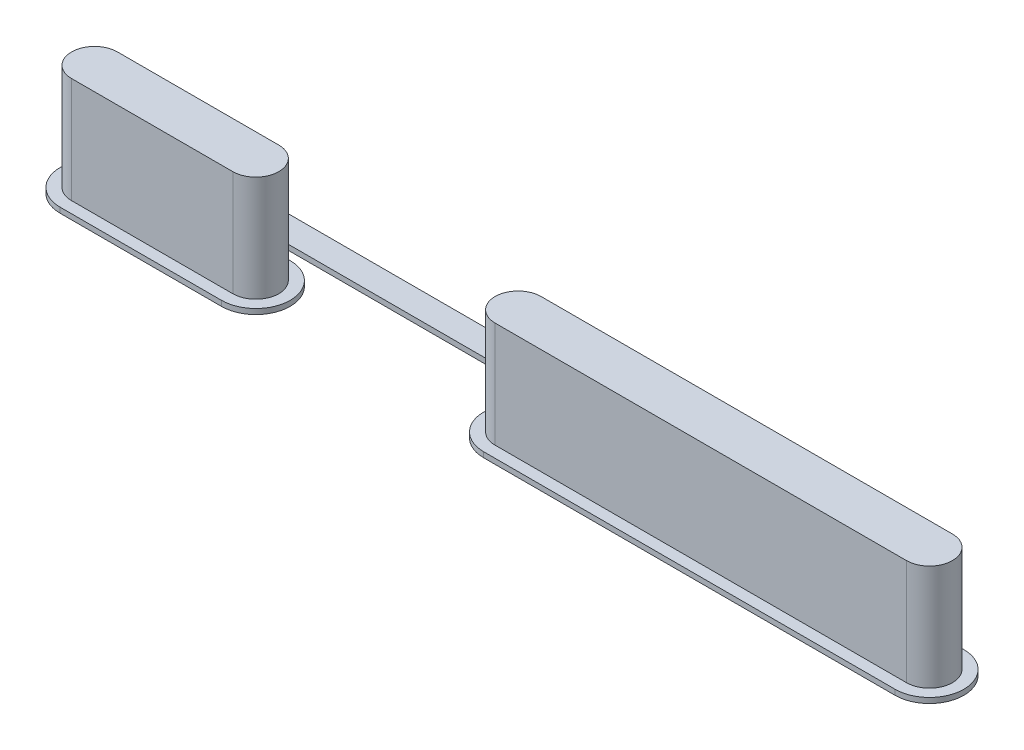
ISO-10303-21;
HEADER;
FILE_DESCRIPTION(('STEP AP214'),'2;1');
FILE_NAME('part.step','',(''),(''),'','','');
FILE_SCHEMA(('AUTOMOTIVE_DESIGN { 1 0 10303 214 1 1 1 1 }'));
ENDSEC;
DATA;
#1=APPLICATION_CONTEXT('core data for automotive mechanical design processes');
#2=APPLICATION_PROTOCOL_DEFINITION('international standard','automotive_design',2000,#1);
#3=PRODUCT_CONTEXT('',#1,'mechanical');
#4=PRODUCT('Part','Part','',(#3));
#5=PRODUCT_RELATED_PRODUCT_CATEGORY('part','',(#4));
#6=PRODUCT_DEFINITION_FORMATION('','',#4);
#7=PRODUCT_DEFINITION_CONTEXT('part definition',#1,'design');
#8=PRODUCT_DEFINITION('design','',#6,#7);
#9=PRODUCT_DEFINITION_SHAPE('','',#8);
#10=(LENGTH_UNIT() NAMED_UNIT(*) SI_UNIT(.MILLI.,.METRE.));
#11=(NAMED_UNIT(*) PLANE_ANGLE_UNIT() SI_UNIT($,.RADIAN.));
#12=(NAMED_UNIT(*) SI_UNIT($,.STERADIAN.) SOLID_ANGLE_UNIT());
#13=UNCERTAINTY_MEASURE_WITH_UNIT(LENGTH_MEASURE(1.E-05),#10,'distance_accuracy_value','');
#14=(GEOMETRIC_REPRESENTATION_CONTEXT(3) GLOBAL_UNCERTAINTY_ASSIGNED_CONTEXT((#13)) GLOBAL_UNIT_ASSIGNED_CONTEXT((#10,
#11,#12)) REPRESENTATION_CONTEXT('',''));
#15=CARTESIAN_POINT('',(0.,0.,0.));
#16=DIRECTION('',(0.,0.,1.));
#17=DIRECTION('',(1.,0.,0.));
#18=AXIS2_PLACEMENT_3D('',#15,#16,#17);
#19=CARTESIAN_POINT('',(16.4719,5.08,0.));
#20=DIRECTION('',(0.,-1.,0.));
#21=DIRECTION('',(0.,0.,-1.));
#22=AXIS2_PLACEMENT_3D('',#19,#20,#21);
#23=CYLINDRICAL_SURFACE('',#22,1.1049);
#24=CARTESIAN_POINT('',(16.4719,0.,0.));
#25=DIRECTION('',(0.,1.,0.));
#26=DIRECTION('',(0.,0.,1.));
#27=AXIS2_PLACEMENT_3D('',#24,#25,#26);
#28=CIRCLE('',#27,1.1049);
#29=CARTESIAN_POINT('',(16.4719,0.,-1.1049));
#30=VERTEX_POINT('',#29);
#31=CARTESIAN_POINT('',(16.4719,0.,1.1049));
#32=VERTEX_POINT('',#31);
#33=EDGE_CURVE('E12',#30,#32,#28,.T.);
#34=ORIENTED_EDGE('',*,*,#33,.T.);
#35=DIRECTION('',(0.,-1.,0.));
#36=VECTOR('',#35,1.);
#37=CARTESIAN_POINT('',(16.4719,5.08,1.1049));
#38=LINE('',#37,#36);
#39=CARTESIAN_POINT('',(16.4719,5.08,1.1049));
#40=VERTEX_POINT('',#39);
#41=EDGE_CURVE('E119',#40,#32,#38,.T.);
#42=ORIENTED_EDGE('',*,*,#41,.F.);
#43=CARTESIAN_POINT('',(16.4719,5.08,0.));
#44=DIRECTION('',(0.,1.,0.));
#45=DIRECTION('',(0.,0.,1.));
#46=AXIS2_PLACEMENT_3D('',#43,#44,#45);
#47=CIRCLE('',#46,1.1049);
#48=CARTESIAN_POINT('',(16.4719,5.08,-1.1049));
#49=VERTEX_POINT('',#48);
#50=EDGE_CURVE('E52',#49,#40,#47,.T.);
#51=ORIENTED_EDGE('',*,*,#50,.F.);
#52=DIRECTION('',(0.,-1.,0.));
#53=VECTOR('',#52,1.);
#54=CARTESIAN_POINT('',(16.4719,5.08,-1.1049));
#55=LINE('',#54,#53);
#56=EDGE_CURVE('E107',#49,#30,#55,.T.);
#57=ORIENTED_EDGE('',*,*,#56,.T.);
#58=EDGE_LOOP('',(#34,#42,#51,#57));
#59=FACE_BOUND('',#58,.T.);
#60=ADVANCED_FACE('F48',(#59),#23,.T.);
#61=CARTESIAN_POINT('',(16.4719,5.08,1.1049));
#62=DIRECTION('',(0.,0.,-1.));
#63=DIRECTION('',(-1.,0.,0.));
#64=AXIS2_PLACEMENT_3D('',#61,#62,#63);
#65=PLANE('',#64);
#66=DIRECTION('',(1.,0.,0.));
#67=VECTOR('',#66,1.);
#68=CARTESIAN_POINT('',(16.4719,0.,1.1049));
#69=LINE('',#68,#67);
#70=CARTESIAN_POINT('',(36.2331,0.,1.1049));
#71=VERTEX_POINT('',#70);
#72=EDGE_CURVE('E58',#32,#71,#69,.T.);
#73=ORIENTED_EDGE('',*,*,#72,.T.);
#74=DIRECTION('',(0.,-1.,0.));
#75=VECTOR('',#74,1.);
#76=CARTESIAN_POINT('',(36.2331,5.08,1.1049));
#77=LINE('',#76,#75);
#78=CARTESIAN_POINT('',(36.2331,5.08,1.1049));
#79=VERTEX_POINT('',#78);
#80=EDGE_CURVE('E103',#79,#71,#77,.T.);
#81=ORIENTED_EDGE('',*,*,#80,.F.);
#82=DIRECTION('',(1.,0.,0.));
#83=VECTOR('',#82,1.);
#84=CARTESIAN_POINT('',(16.4719,5.08,1.1049));
#85=LINE('',#84,#83);
#86=EDGE_CURVE('E82',#40,#79,#85,.T.);
#87=ORIENTED_EDGE('',*,*,#86,.F.);
#88=ORIENTED_EDGE('',*,*,#41,.T.);
#89=EDGE_LOOP('',(#73,#81,#87,#88));
#90=FACE_BOUND('',#89,.T.);
#91=ADVANCED_FACE('F122',(#90),#65,.F.);
#92=CARTESIAN_POINT('',(36.2331,5.08,0.));
#93=DIRECTION('',(0.,-1.,0.));
#94=DIRECTION('',(0.,0.,-1.));
#95=AXIS2_PLACEMENT_3D('',#92,#93,#94);
#96=CYLINDRICAL_SURFACE('',#95,1.1049);
#97=CARTESIAN_POINT('',(36.2331,0.,0.));
#98=DIRECTION('',(0.,1.,0.));
#99=DIRECTION('',(0.,0.,1.));
#100=AXIS2_PLACEMENT_3D('',#97,#98,#99);
#101=CIRCLE('',#100,1.1049);
#102=CARTESIAN_POINT('',(36.2331,0.,-1.1049));
#103=VERTEX_POINT('',#102);
#104=EDGE_CURVE('E98',#71,#103,#101,.T.);
#105=ORIENTED_EDGE('',*,*,#104,.T.);
#106=DIRECTION('',(0.,-1.,0.));
#107=VECTOR('',#106,1.);
#108=CARTESIAN_POINT('',(36.2331,5.08,-1.1049));
#109=LINE('',#108,#107);
#110=CARTESIAN_POINT('',(36.2331,5.08,-1.1049));
#111=VERTEX_POINT('',#110);
#112=EDGE_CURVE('E101',#111,#103,#109,.T.);
#113=ORIENTED_EDGE('',*,*,#112,.F.);
#114=CARTESIAN_POINT('',(36.2331,5.08,0.));
#115=DIRECTION('',(0.,1.,0.));
#116=DIRECTION('',(0.,0.,1.));
#117=AXIS2_PLACEMENT_3D('',#114,#115,#116);
#118=CIRCLE('',#117,1.1049);
#119=EDGE_CURVE('E115',#79,#111,#118,.T.);
#120=ORIENTED_EDGE('',*,*,#119,.F.);
#121=ORIENTED_EDGE('',*,*,#80,.T.);
#122=EDGE_LOOP('',(#105,#113,#120,#121));
#123=FACE_BOUND('',#122,.T.);
#124=ADVANCED_FACE('F99',(#123),#96,.T.);
#125=CARTESIAN_POINT('',(16.4719,5.08,-1.1049));
#126=DIRECTION('',(0.,0.,1.));
#127=DIRECTION('',(1.,0.,0.));
#128=AXIS2_PLACEMENT_3D('',#125,#126,#127);
#129=PLANE('',#128);
#130=DIRECTION('',(-1.,0.,0.));
#131=VECTOR('',#130,1.);
#132=CARTESIAN_POINT('',(16.4719,0.,-1.1049));
#133=LINE('',#132,#131);
#134=EDGE_CURVE('E92',#103,#30,#133,.T.);
#135=ORIENTED_EDGE('',*,*,#134,.T.);
#136=ORIENTED_EDGE('',*,*,#56,.F.);
#137=DIRECTION('',(-1.,0.,0.));
#138=VECTOR('',#137,1.);
#139=CARTESIAN_POINT('',(16.4719,5.08,-1.1049));
#140=LINE('',#139,#138);
#141=EDGE_CURVE('E106',#111,#49,#140,.T.);
#142=ORIENTED_EDGE('',*,*,#141,.F.);
#143=ORIENTED_EDGE('',*,*,#112,.T.);
#144=EDGE_LOOP('',(#135,#136,#142,#143));
#145=FACE_BOUND('',#144,.T.);
#146=ADVANCED_FACE('F105',(#145),#129,.F.);
#147=CARTESIAN_POINT('',(16.4719,5.08,0.));
#148=DIRECTION('',(0.,1.,0.));
#149=DIRECTION('',(0.,0.,1.));
#150=AXIS2_PLACEMENT_3D('',#147,#148,#149);
#151=PLANE('',#150);
#152=ORIENTED_EDGE('',*,*,#50,.T.);
#153=ORIENTED_EDGE('',*,*,#86,.T.);
#154=ORIENTED_EDGE('',*,*,#119,.T.);
#155=ORIENTED_EDGE('',*,*,#141,.T.);
#156=EDGE_LOOP('',(#152,#153,#154,#155));
#157=FACE_BOUND('',#156,.T.);
#158=ADVANCED_FACE('F50',(#157),#151,.T.);
#159=CARTESIAN_POINT('',(16.4719,0.,0.));
#160=DIRECTION('',(0.,1.,0.));
#161=DIRECTION('',(0.,0.,1.));
#162=AXIS2_PLACEMENT_3D('',#159,#160,#161);
#163=PLANE('',#162);
#164=ORIENTED_EDGE('',*,*,#33,.F.);
#165=ORIENTED_EDGE('',*,*,#134,.F.);
#166=ORIENTED_EDGE('',*,*,#104,.F.);
#167=ORIENTED_EDGE('',*,*,#72,.F.);
#168=EDGE_LOOP('',(#164,#165,#166,#167));
#169=FACE_BOUND('',#168,.T.);
#170=ADVANCED_FACE('F109',(#169),#163,.F.);
#171=CLOSED_SHELL('',(#60,#91,#124,#146,#158,#170));
#172=MANIFOLD_SOLID_BREP('B2',#171);
#173=CARTESIAN_POINT('',(-3.8735,-0.254,-1.651));
#174=DIRECTION('',(0.,0.,-1.));
#175=DIRECTION('',(-1.,0.,0.));
#176=AXIS2_PLACEMENT_3D('',#173,#174,#175);
#177=PLANE('',#176);
#178=DIRECTION('',(-1.,0.,0.));
#179=VECTOR('',#178,1.);
#180=CARTESIAN_POINT('',(-3.8735,0.,-1.651));
#181=LINE('',#180,#179);
#182=CARTESIAN_POINT('',(-0.889000000000001,0.,-1.651));
#183=VERTEX_POINT('',#182);
#184=CARTESIAN_POINT('',(-3.8735,0.,-1.651));
#185=VERTEX_POINT('',#184);
#186=EDGE_CURVE('E491',#183,#185,#181,.T.);
#187=ORIENTED_EDGE('',*,*,#186,.F.);
#188=DIRECTION('',(0.,1.,0.));
#189=VECTOR('',#188,1.);
#190=CARTESIAN_POINT('',(-0.889,-0.254,-1.651));
#191=LINE('',#190,#189);
#192=CARTESIAN_POINT('',(-0.889000000000001,-0.254,-1.651));
#193=VERTEX_POINT('',#192);
#194=EDGE_CURVE('E537',#183,#193,#191,.F.);
#195=ORIENTED_EDGE('',*,*,#194,.T.);
#196=DIRECTION('',(-1.,0.,0.));
#197=VECTOR('',#196,1.);
#198=CARTESIAN_POINT('',(-3.8735,-0.254,-1.651));
#199=LINE('',#198,#197);
#200=CARTESIAN_POINT('',(-3.8735,-0.254,-1.651));
#201=VERTEX_POINT('',#200);
#202=EDGE_CURVE('E479',#193,#201,#199,.T.);
#203=ORIENTED_EDGE('',*,*,#202,.T.);
#204=DIRECTION('',(0.,1.,0.));
#205=VECTOR('',#204,1.);
#206=CARTESIAN_POINT('',(-3.8735,-0.254,-1.651));
#207=LINE('',#206,#205);
#208=EDGE_CURVE('E493',#201,#185,#207,.T.);
#209=ORIENTED_EDGE('',*,*,#208,.T.);
#210=EDGE_LOOP('',(#187,#195,#203,#209));
#211=FACE_BOUND('',#210,.T.);
#212=ADVANCED_FACE('F172',(#211),#177,.T.);
#213=CARTESIAN_POINT('',(-3.8735,5.08,0.));
#214=DIRECTION('',(0.,-1.,0.));
#215=DIRECTION('',(0.,0.,-1.));
#216=AXIS2_PLACEMENT_3D('',#213,#214,#215);
#217=CYLINDRICAL_SURFACE('',#216,1.1049);
#218=CARTESIAN_POINT('',(-3.8735,0.,0.));
#219=DIRECTION('',(0.,1.,0.));
#220=DIRECTION('',(0.,0.,1.));
#221=AXIS2_PLACEMENT_3D('',#218,#219,#220);
#222=CIRCLE('',#221,1.1049);
#223=CARTESIAN_POINT('',(-3.8735,0.,-1.1049));
#224=VERTEX_POINT('',#223);
#225=CARTESIAN_POINT('',(-3.8735,0.,1.1049));
#226=VERTEX_POINT('',#225);
#227=EDGE_CURVE('E496',#224,#226,#222,.T.);
#228=ORIENTED_EDGE('',*,*,#227,.T.);
#229=DIRECTION('',(0.,-1.,0.));
#230=VECTOR('',#229,1.);
#231=CARTESIAN_POINT('',(-3.8735,5.08,1.1049));
#232=LINE('',#231,#230);
#233=CARTESIAN_POINT('',(-3.8735,5.08,1.1049));
#234=VERTEX_POINT('',#233);
#235=EDGE_CURVE('E531',#234,#226,#232,.T.);
#236=ORIENTED_EDGE('',*,*,#235,.F.);
#237=CARTESIAN_POINT('',(-3.8735,5.08,0.));
#238=DIRECTION('',(0.,1.,0.));
#239=DIRECTION('',(0.,0.,1.));
#240=AXIS2_PLACEMENT_3D('',#237,#238,#239);
#241=CIRCLE('',#240,1.1049);
#242=CARTESIAN_POINT('',(-3.8735,5.08,-1.1049));
#243=VERTEX_POINT('',#242);
#244=EDGE_CURVE('E502',#243,#234,#241,.T.);
#245=ORIENTED_EDGE('',*,*,#244,.F.);
#246=DIRECTION('',(0.,-1.,0.));
#247=VECTOR('',#246,1.);
#248=CARTESIAN_POINT('',(-3.8735,5.08,-1.1049));
#249=LINE('',#248,#247);
#250=EDGE_CURVE('E512',#243,#224,#249,.T.);
#251=ORIENTED_EDGE('',*,*,#250,.T.);
#252=EDGE_LOOP('',(#228,#236,#245,#251));
#253=FACE_BOUND('',#252,.T.);
#254=ADVANCED_FACE('F587',(#253),#217,.T.);
#255=CARTESIAN_POINT('',(-3.8735,5.08,1.1049));
#256=DIRECTION('',(0.,0.,-1.));
#257=DIRECTION('',(-1.,0.,0.));
#258=AXIS2_PLACEMENT_3D('',#255,#256,#257);
#259=PLANE('',#258);
#260=DIRECTION('',(1.,0.,0.));
#261=VECTOR('',#260,1.);
#262=CARTESIAN_POINT('',(-3.8735,0.,1.1049));
#263=LINE('',#262,#261);
#264=CARTESIAN_POINT('',(3.8735,0.,1.1049));
#265=VERTEX_POINT('',#264);
#266=EDGE_CURVE('E515',#226,#265,#263,.T.);
#267=ORIENTED_EDGE('',*,*,#266,.T.);
#268=DIRECTION('',(0.,-1.,0.));
#269=VECTOR('',#268,1.);
#270=CARTESIAN_POINT('',(3.8735,5.08,1.1049));
#271=LINE('',#270,#269);
#272=CARTESIAN_POINT('',(3.8735,5.08,1.1049));
#273=VERTEX_POINT('',#272);
#274=EDGE_CURVE('E528',#273,#265,#271,.T.);
#275=ORIENTED_EDGE('',*,*,#274,.F.);
#276=DIRECTION('',(1.,0.,0.));
#277=VECTOR('',#276,1.);
#278=CARTESIAN_POINT('',(-3.8735,5.08,1.1049));
#279=LINE('',#278,#277);
#280=EDGE_CURVE('E505',#234,#273,#279,.T.);
#281=ORIENTED_EDGE('',*,*,#280,.F.);
#282=ORIENTED_EDGE('',*,*,#235,.T.);
#283=EDGE_LOOP('',(#267,#275,#281,#282));
#284=FACE_BOUND('',#283,.T.);
#285=ADVANCED_FACE('F596',(#284),#259,.F.);
#286=CARTESIAN_POINT('',(3.8735,5.08,0.));
#287=DIRECTION('',(0.,-1.,0.));
#288=DIRECTION('',(0.,0.,-1.));
#289=AXIS2_PLACEMENT_3D('',#286,#287,#288);
#290=CYLINDRICAL_SURFACE('',#289,1.1049);
#291=CARTESIAN_POINT('',(3.8735,0.,0.));
#292=DIRECTION('',(0.,1.,0.));
#293=DIRECTION('',(0.,0.,1.));
#294=AXIS2_PLACEMENT_3D('',#291,#292,#293);
#295=CIRCLE('',#294,1.1049);
#296=CARTESIAN_POINT('',(3.8735,0.,-1.1049));
#297=VERTEX_POINT('',#296);
#298=EDGE_CURVE('E518',#265,#297,#295,.T.);
#299=ORIENTED_EDGE('',*,*,#298,.T.);
#300=DIRECTION('',(0.,-1.,0.));
#301=VECTOR('',#300,1.);
#302=CARTESIAN_POINT('',(3.8735,5.08,-1.1049));
#303=LINE('',#302,#301);
#304=CARTESIAN_POINT('',(3.8735,5.08,-1.1049));
#305=VERTEX_POINT('',#304);
#306=EDGE_CURVE('E525',#305,#297,#303,.T.);
#307=ORIENTED_EDGE('',*,*,#306,.F.);
#308=CARTESIAN_POINT('',(3.8735,5.08,0.));
#309=DIRECTION('',(0.,1.,0.));
#310=DIRECTION('',(0.,0.,1.));
#311=AXIS2_PLACEMENT_3D('',#308,#309,#310);
#312=CIRCLE('',#311,1.1049);
#313=EDGE_CURVE('E508',#273,#305,#312,.T.);
#314=ORIENTED_EDGE('',*,*,#313,.F.);
#315=ORIENTED_EDGE('',*,*,#274,.T.);
#316=EDGE_LOOP('',(#299,#307,#314,#315));
#317=FACE_BOUND('',#316,.T.);
#318=ADVANCED_FACE('F680',(#317),#290,.T.);
#319=CARTESIAN_POINT('',(-3.8735,5.08,-1.1049));
#320=DIRECTION('',(0.,0.,1.));
#321=DIRECTION('',(1.,0.,0.));
#322=AXIS2_PLACEMENT_3D('',#319,#320,#321);
#323=PLANE('',#322);
#324=DIRECTION('',(-1.,0.,0.));
#325=VECTOR('',#324,1.);
#326=CARTESIAN_POINT('',(-3.8735,0.,-1.1049));
#327=LINE('',#326,#325);
#328=EDGE_CURVE('E506',#297,#224,#327,.T.);
#329=ORIENTED_EDGE('',*,*,#328,.T.);
#330=ORIENTED_EDGE('',*,*,#250,.F.);
#331=DIRECTION('',(-1.,0.,0.));
#332=VECTOR('',#331,1.);
#333=CARTESIAN_POINT('',(-3.8735,5.08,-1.1049));
#334=LINE('',#333,#332);
#335=EDGE_CURVE('E510',#305,#243,#334,.T.);
#336=ORIENTED_EDGE('',*,*,#335,.F.);
#337=ORIENTED_EDGE('',*,*,#306,.T.);
#338=EDGE_LOOP('',(#329,#330,#336,#337));
#339=FACE_BOUND('',#338,.T.);
#340=ADVANCED_FACE('F674',(#339),#323,.F.);
#341=CARTESIAN_POINT('',(-3.8735,5.08,0.));
#342=DIRECTION('',(0.,1.,0.));
#343=DIRECTION('',(0.,0.,1.));
#344=AXIS2_PLACEMENT_3D('',#341,#342,#343);
#345=PLANE('',#344);
#346=ORIENTED_EDGE('',*,*,#244,.T.);
#347=ORIENTED_EDGE('',*,*,#280,.T.);
#348=ORIENTED_EDGE('',*,*,#313,.T.);
#349=ORIENTED_EDGE('',*,*,#335,.T.);
#350=EDGE_LOOP('',(#346,#347,#348,#349));
#351=FACE_BOUND('',#350,.T.);
#352=ADVANCED_FACE('F670',(#351),#345,.T.);
#353=CARTESIAN_POINT('',(-3.8735,0.,0.));
#354=DIRECTION('',(0.,1.,0.));
#355=DIRECTION('',(0.,0.,1.));
#356=AXIS2_PLACEMENT_3D('',#353,#354,#355);
#357=PLANE('',#356);
#358=CARTESIAN_POINT('',(-3.8735,0.,0.));
#359=DIRECTION('',(0.,1.,0.));
#360=DIRECTION('',(0.,0.,1.));
#361=AXIS2_PLACEMENT_3D('',#358,#359,#360);
#362=CIRCLE('',#361,1.651);
#363=CARTESIAN_POINT('',(-3.8735,0.,1.651));
#364=VERTEX_POINT('',#363);
#365=EDGE_CURVE('E426',#185,#364,#362,.T.);
#366=ORIENTED_EDGE('',*,*,#365,.T.);
#367=DIRECTION('',(1.,0.,0.));
#368=VECTOR('',#367,1.);
#369=CARTESIAN_POINT('',(-3.8735,0.,1.651));
#370=LINE('',#369,#368);
#371=CARTESIAN_POINT('',(3.8735,0.,1.651));
#372=VERTEX_POINT('',#371);
#373=EDGE_CURVE('E485',#364,#372,#370,.T.);
#374=ORIENTED_EDGE('',*,*,#373,.T.);
#375=CARTESIAN_POINT('',(3.8735,0.,0.));
#376=DIRECTION('',(0.,1.,0.));
#377=DIRECTION('',(0.,0.,1.));
#378=AXIS2_PLACEMENT_3D('',#375,#376,#377);
#379=CIRCLE('',#378,1.651);
#380=CARTESIAN_POINT('',(3.8735,0.,-1.651));
#381=VERTEX_POINT('',#380);
#382=EDGE_CURVE('E488',#372,#381,#379,.T.);
#383=ORIENTED_EDGE('',*,*,#382,.T.);
#384=CARTESIAN_POINT('',(0.888999999999999,0.,-1.651));
#385=VERTEX_POINT('',#384);
#386=EDGE_CURVE('E473',#381,#385,#181,.T.);
#387=ORIENTED_EDGE('',*,*,#386,.T.);
#388=CARTESIAN_POINT('',(0.889,0.,-1.905));
#389=DIRECTION('',(0.,1.,0.));
#390=DIRECTION('',(0.,0.,1.));
#391=AXIS2_PLACEMENT_3D('',#388,#389,#390);
#392=CIRCLE('',#391,0.254);
#393=CARTESIAN_POINT('',(0.635,0.,-1.905));
#394=VERTEX_POINT('',#393);
#395=EDGE_CURVE('E180',#385,#394,#392,.F.);
#396=ORIENTED_EDGE('',*,*,#395,.T.);
#397=DIRECTION('',(0.,0.,-1.));
#398=VECTOR('',#397,1.);
#399=CARTESIAN_POINT('',(0.635,0.,-1.651));
#400=LINE('',#399,#398);
#401=CARTESIAN_POINT('',(0.635,0.,-2.032));
#402=VERTEX_POINT('',#401);
#403=EDGE_CURVE('E441',#394,#402,#400,.T.);
#404=ORIENTED_EDGE('',*,*,#403,.T.);
#405=CARTESIAN_POINT('',(0.889,0.,-2.032));
#406=DIRECTION('',(0.,1.,0.));
#407=DIRECTION('',(1.,0.,0.));
#408=AXIS2_PLACEMENT_3D('',#405,#406,#407);
#409=CIRCLE('',#408,0.254);
#410=CARTESIAN_POINT('',(0.889,0.,-2.286));
#411=VERTEX_POINT('',#410);
#412=EDGE_CURVE('E443',#402,#411,#409,.F.);
#413=ORIENTED_EDGE('',*,*,#412,.T.);
#414=DIRECTION('',(1.,0.,0.));
#415=VECTOR('',#414,1.);
#416=CARTESIAN_POINT('',(0.889,0.,-2.286));
#417=LINE('',#416,#415);
#418=CARTESIAN_POINT('',(25.4635,0.,-2.286));
#419=VERTEX_POINT('',#418);
#420=EDGE_CURVE('E446',#411,#419,#417,.T.);
#421=ORIENTED_EDGE('',*,*,#420,.T.);
#422=CARTESIAN_POINT('',(25.4635,0.,-2.032));
#423=DIRECTION('',(0.,1.,0.));
#424=DIRECTION('',(1.,0.,0.));
#425=AXIS2_PLACEMENT_3D('',#422,#423,#424);
#426=CIRCLE('',#425,0.254);
#427=CARTESIAN_POINT('',(25.7175,0.,-2.032));
#428=VERTEX_POINT('',#427);
#429=EDGE_CURVE('E449',#419,#428,#426,.F.);
#430=ORIENTED_EDGE('',*,*,#429,.T.);
#431=DIRECTION('',(0.,0.,-1.));
#432=VECTOR('',#431,1.);
#433=CARTESIAN_POINT('',(25.7175,0.,-2.032));
#434=LINE('',#433,#432);
#435=CARTESIAN_POINT('',(25.7175,0.,-1.905));
#436=VERTEX_POINT('',#435);
#437=EDGE_CURVE('E383',#428,#436,#434,.F.);
#438=ORIENTED_EDGE('',*,*,#437,.T.);
#439=CARTESIAN_POINT('',(25.4635,0.,-1.905));
#440=DIRECTION('',(0.,1.,0.));
#441=DIRECTION('',(0.,0.,1.));
#442=AXIS2_PLACEMENT_3D('',#439,#440,#441);
#443=CIRCLE('',#442,0.254);
#444=CARTESIAN_POINT('',(25.4635,0.,-1.651));
#445=VERTEX_POINT('',#444);
#446=EDGE_CURVE('E364',#436,#445,#443,.F.);
#447=ORIENTED_EDGE('',*,*,#446,.T.);
#448=DIRECTION('',(-1.,0.,0.));
#449=VECTOR('',#448,1.);
#450=CARTESIAN_POINT('',(16.4719,0.,-1.651));
#451=LINE('',#450,#449);
#452=CARTESIAN_POINT('',(16.4719,0.,-1.651));
#453=VERTEX_POINT('',#452);
#454=EDGE_CURVE('E355',#445,#453,#451,.T.);
#455=ORIENTED_EDGE('',*,*,#454,.T.);
#456=CARTESIAN_POINT('',(16.4719,0.,0.));
#457=DIRECTION('',(0.,1.,0.));
#458=DIRECTION('',(0.,0.,1.));
#459=AXIS2_PLACEMENT_3D('',#456,#457,#458);
#460=CIRCLE('',#459,1.651);
#461=CARTESIAN_POINT('',(16.4719,0.,1.651));
#462=VERTEX_POINT('',#461);
#463=EDGE_CURVE('E362',#453,#462,#460,.T.);
#464=ORIENTED_EDGE('',*,*,#463,.T.);
#465=DIRECTION('',(1.,0.,0.));
#466=VECTOR('',#465,1.);
#467=CARTESIAN_POINT('',(16.4719,0.,1.651));
#468=LINE('',#467,#466);
#469=CARTESIAN_POINT('',(36.2331,0.,1.651));
#470=VERTEX_POINT('',#469);
#471=EDGE_CURVE('E384',#462,#470,#468,.T.);
#472=ORIENTED_EDGE('',*,*,#471,.T.);
#473=CARTESIAN_POINT('',(36.2331,0.,0.));
#474=DIRECTION('',(0.,1.,0.));
#475=DIRECTION('',(0.,0.,1.));
#476=AXIS2_PLACEMENT_3D('',#473,#474,#475);
#477=CIRCLE('',#476,1.651);
#478=CARTESIAN_POINT('',(36.2331,0.,-1.651));
#479=VERTEX_POINT('',#478);
#480=EDGE_CURVE('E388',#470,#479,#477,.T.);
#481=ORIENTED_EDGE('',*,*,#480,.T.);
#482=CARTESIAN_POINT('',(27.2415,0.,-1.651));
#483=VERTEX_POINT('',#482);
#484=EDGE_CURVE('E367',#479,#483,#451,.T.);
#485=ORIENTED_EDGE('',*,*,#484,.T.);
#486=CARTESIAN_POINT('',(27.2415,0.,-1.905));
#487=DIRECTION('',(0.,1.,0.));
#488=DIRECTION('',(0.,0.,1.));
#489=AXIS2_PLACEMENT_3D('',#486,#487,#488);
#490=CIRCLE('',#489,0.254);
#491=CARTESIAN_POINT('',(26.9875,0.,-1.905));
#492=VERTEX_POINT('',#491);
#493=EDGE_CURVE('E557',#483,#492,#490,.F.);
#494=ORIENTED_EDGE('',*,*,#493,.T.);
#495=DIRECTION('',(0.,0.,-1.));
#496=VECTOR('',#495,1.);
#497=CARTESIAN_POINT('',(26.9875,0.,-2.032));
#498=LINE('',#497,#496);
#499=CARTESIAN_POINT('',(26.9875,0.,-2.032));
#500=VERTEX_POINT('',#499);
#501=EDGE_CURVE('E386',#500,#492,#498,.F.);
#502=ORIENTED_EDGE('',*,*,#501,.F.);
#503=CARTESIAN_POINT('',(25.4635,0.,-2.032));
#504=DIRECTION('',(0.,1.,0.));
#505=DIRECTION('',(1.,0.,0.));
#506=AXIS2_PLACEMENT_3D('',#503,#504,#505);
#507=CIRCLE('',#506,1.524);
#508=CARTESIAN_POINT('',(25.4635,0.,-3.556));
#509=VERTEX_POINT('',#508);
#510=EDGE_CURVE('E430',#509,#500,#507,.F.);
#511=ORIENTED_EDGE('',*,*,#510,.F.);
#512=DIRECTION('',(1.,0.,0.));
#513=VECTOR('',#512,1.);
#514=CARTESIAN_POINT('',(0.889,0.,-3.556));
#515=LINE('',#514,#513);
#516=CARTESIAN_POINT('',(0.889,0.,-3.556));
#517=VERTEX_POINT('',#516);
#518=EDGE_CURVE('E433',#517,#509,#515,.T.);
#519=ORIENTED_EDGE('',*,*,#518,.F.);
#520=CARTESIAN_POINT('',(0.889,0.,-2.032));
#521=DIRECTION('',(0.,1.,0.));
#522=DIRECTION('',(1.,0.,0.));
#523=AXIS2_PLACEMENT_3D('',#520,#521,#522);
#524=CIRCLE('',#523,1.524);
#525=CARTESIAN_POINT('',(-0.635,0.,-2.032));
#526=VERTEX_POINT('',#525);
#527=EDGE_CURVE('E436',#526,#517,#524,.F.);
#528=ORIENTED_EDGE('',*,*,#527,.F.);
#529=DIRECTION('',(0.,0.,-1.));
#530=VECTOR('',#529,1.);
#531=CARTESIAN_POINT('',(-0.635,0.,-1.651));
#532=LINE('',#531,#530);
#533=CARTESIAN_POINT('',(-0.635,0.,-1.905));
#534=VERTEX_POINT('',#533);
#535=EDGE_CURVE('E439',#534,#526,#532,.T.);
#536=ORIENTED_EDGE('',*,*,#535,.F.);
#537=CARTESIAN_POINT('',(-0.889,0.,-1.905));
#538=DIRECTION('',(0.,1.,0.));
#539=DIRECTION('',(0.,0.,1.));
#540=AXIS2_PLACEMENT_3D('',#537,#538,#539);
#541=CIRCLE('',#540,0.254);
#542=EDGE_CURVE('E553',#534,#183,#541,.F.);
#543=ORIENTED_EDGE('',*,*,#542,.T.);
#544=ORIENTED_EDGE('',*,*,#186,.T.);
#545=EDGE_LOOP('',(#366,#374,#383,#387,#396,#404,#413,#421,#430,#438,#447,#455,#464,#472,#481,
#485,#494,#502,#511,#519,#528,#536,#543,#544));
#546=FACE_BOUND('',#545,.T.);
#547=ORIENTED_EDGE('',*,*,#227,.F.);
#548=ORIENTED_EDGE('',*,*,#328,.F.);
#549=ORIENTED_EDGE('',*,*,#298,.F.);
#550=ORIENTED_EDGE('',*,*,#266,.F.);
#551=EDGE_LOOP('',(#547,#548,#549,#550));
#552=FACE_BOUND('',#551,.T.);
#553=ADVANCED_FACE('F358',(#546,#552),#357,.T.);
#554=CARTESIAN_POINT('',(-3.8735,-0.254,0.));
#555=DIRECTION('',(0.,1.,0.));
#556=DIRECTION('',(0.,0.,1.));
#557=AXIS2_PLACEMENT_3D('',#554,#555,#556);
#558=CYLINDRICAL_SURFACE('',#557,1.651);
#559=ORIENTED_EDGE('',*,*,#365,.F.);
#560=ORIENTED_EDGE('',*,*,#208,.F.);
#561=CARTESIAN_POINT('',(-3.8735,-0.254,0.));
#562=DIRECTION('',(0.,1.,0.));
#563=DIRECTION('',(0.,0.,1.));
#564=AXIS2_PLACEMENT_3D('',#561,#562,#563);
#565=CIRCLE('',#564,1.651);
#566=CARTESIAN_POINT('',(-3.8735,-0.254,1.651));
#567=VERTEX_POINT('',#566);
#568=EDGE_CURVE('E469',#201,#567,#565,.T.);
#569=ORIENTED_EDGE('',*,*,#568,.T.);
#570=DIRECTION('',(0.,1.,0.));
#571=VECTOR('',#570,1.);
#572=CARTESIAN_POINT('',(-3.8735,-0.254,1.651));
#573=LINE('',#572,#571);
#574=EDGE_CURVE('E483',#567,#364,#573,.T.);
#575=ORIENTED_EDGE('',*,*,#574,.T.);
#576=EDGE_LOOP('',(#559,#560,#569,#575));
#577=FACE_BOUND('',#576,.T.);
#578=ADVANCED_FACE('F604',(#577),#558,.T.);
#579=CARTESIAN_POINT('',(3.8735,-0.254,-1.651));
#580=VERTEX_POINT('',#579);
#581=CARTESIAN_POINT('',(0.888999999999999,-0.254,-1.651));
#582=VERTEX_POINT('',#581);
#583=EDGE_CURVE('E480',#580,#582,#199,.T.);
#584=ORIENTED_EDGE('',*,*,#583,.T.);
#585=DIRECTION('',(0.,1.,0.));
#586=VECTOR('',#585,1.);
#587=CARTESIAN_POINT('',(0.889,0.,-1.651));
#588=LINE('',#587,#586);
#589=EDGE_CURVE('E549',#582,#385,#588,.T.);
#590=ORIENTED_EDGE('',*,*,#589,.T.);
#591=ORIENTED_EDGE('',*,*,#386,.F.);
#592=DIRECTION('',(0.,1.,0.));
#593=VECTOR('',#592,1.);
#594=CARTESIAN_POINT('',(3.8735,-0.254,-1.651));
#595=LINE('',#594,#593);
#596=EDGE_CURVE('E497',#580,#381,#595,.T.);
#597=ORIENTED_EDGE('',*,*,#596,.F.);
#598=EDGE_LOOP('',(#584,#590,#591,#597));
#599=FACE_BOUND('',#598,.T.);
#600=ADVANCED_FACE('F590',(#599),#177,.T.);
#601=CARTESIAN_POINT('',(3.8735,-0.254,0.));
#602=DIRECTION('',(0.,1.,0.));
#603=DIRECTION('',(0.,0.,1.));
#604=AXIS2_PLACEMENT_3D('',#601,#602,#603);
#605=CYLINDRICAL_SURFACE('',#604,1.651);
#606=ORIENTED_EDGE('',*,*,#382,.F.);
#607=DIRECTION('',(0.,1.,0.));
#608=VECTOR('',#607,1.);
#609=CARTESIAN_POINT('',(3.8735,-0.254,1.651));
#610=LINE('',#609,#608);
#611=CARTESIAN_POINT('',(3.8735,-0.254,1.651));
#612=VERTEX_POINT('',#611);
#613=EDGE_CURVE('E499',#612,#372,#610,.T.);
#614=ORIENTED_EDGE('',*,*,#613,.F.);
#615=CARTESIAN_POINT('',(3.8735,-0.254,0.));
#616=DIRECTION('',(0.,1.,0.));
#617=DIRECTION('',(0.,0.,1.));
#618=AXIS2_PLACEMENT_3D('',#615,#616,#617);
#619=CIRCLE('',#618,1.651);
#620=EDGE_CURVE('E476',#612,#580,#619,.T.);
#621=ORIENTED_EDGE('',*,*,#620,.T.);
#622=ORIENTED_EDGE('',*,*,#596,.T.);
#623=EDGE_LOOP('',(#606,#614,#621,#622));
#624=FACE_BOUND('',#623,.T.);
#625=ADVANCED_FACE('F603',(#624),#605,.T.);
#626=CARTESIAN_POINT('',(-3.8735,-0.254,1.651));
#627=DIRECTION('',(0.,0.,1.));
#628=DIRECTION('',(1.,0.,0.));
#629=AXIS2_PLACEMENT_3D('',#626,#627,#628);
#630=PLANE('',#629);
#631=ORIENTED_EDGE('',*,*,#373,.F.);
#632=ORIENTED_EDGE('',*,*,#574,.F.);
#633=DIRECTION('',(1.,0.,0.));
#634=VECTOR('',#633,1.);
#635=CARTESIAN_POINT('',(-3.8735,-0.254,1.651));
#636=LINE('',#635,#634);
#637=EDGE_CURVE('E472',#567,#612,#636,.T.);
#638=ORIENTED_EDGE('',*,*,#637,.T.);
#639=ORIENTED_EDGE('',*,*,#613,.T.);
#640=EDGE_LOOP('',(#631,#632,#638,#639));
#641=FACE_BOUND('',#640,.T.);
#642=ADVANCED_FACE('F610',(#641),#630,.T.);
#643=CARTESIAN_POINT('',(-3.8735,-0.254,0.));
#644=DIRECTION('',(0.,1.,0.));
#645=DIRECTION('',(0.,0.,1.));
#646=AXIS2_PLACEMENT_3D('',#643,#644,#645);
#647=PLANE('',#646);
#648=ORIENTED_EDGE('',*,*,#568,.F.);
#649=ORIENTED_EDGE('',*,*,#202,.F.);
#650=CARTESIAN_POINT('',(-0.889,-0.254000000000001,-1.905));
#651=DIRECTION('',(0.,1.,0.));
#652=DIRECTION('',(0.,0.,1.));
#653=AXIS2_PLACEMENT_3D('',#650,#651,#652);
#654=CIRCLE('',#653,0.254);
#655=CARTESIAN_POINT('',(-0.635,-0.254000000000001,-1.905));
#656=VERTEX_POINT('',#655);
#657=EDGE_CURVE('E555',#193,#656,#654,.T.);
#658=ORIENTED_EDGE('',*,*,#657,.T.);
#659=DIRECTION('',(0.,0.,1.));
#660=VECTOR('',#659,1.);
#661=CARTESIAN_POINT('',(-0.635,-0.254000000000001,-1.651));
#662=LINE('',#661,#660);
#663=CARTESIAN_POINT('',(-0.635,-0.254000000000001,-2.032));
#664=VERTEX_POINT('',#663);
#665=EDGE_CURVE('E414',#664,#656,#662,.T.);
#666=ORIENTED_EDGE('',*,*,#665,.F.);
#667=CARTESIAN_POINT('',(0.889,-0.254000000000001,-2.032));
#668=DIRECTION('',(0.,1.,0.));
#669=DIRECTION('',(0.,0.,1.));
#670=AXIS2_PLACEMENT_3D('',#667,#668,#669);
#671=CIRCLE('',#670,1.524);
#672=CARTESIAN_POINT('',(0.889,-0.254000000000001,-3.556));
#673=VERTEX_POINT('',#672);
#674=EDGE_CURVE('E411',#673,#664,#671,.T.);
#675=ORIENTED_EDGE('',*,*,#674,.F.);
#676=DIRECTION('',(-1.,0.,0.));
#677=VECTOR('',#676,1.);
#678=CARTESIAN_POINT('',(0.889,-0.254000000000001,-3.556));
#679=LINE('',#678,#677);
#680=CARTESIAN_POINT('',(25.4635,-0.254000000000001,-3.556));
#681=VERTEX_POINT('',#680);
#682=EDGE_CURVE('E408',#681,#673,#679,.T.);
#683=ORIENTED_EDGE('',*,*,#682,.F.);
#684=CARTESIAN_POINT('',(25.4635,-0.254000000000001,-2.032));
#685=DIRECTION('',(0.,1.,0.));
#686=DIRECTION('',(0.,0.,1.));
#687=AXIS2_PLACEMENT_3D('',#684,#685,#686);
#688=CIRCLE('',#687,1.524);
#689=CARTESIAN_POINT('',(26.9875,-0.254000000000001,-2.032));
#690=VERTEX_POINT('',#689);
#691=EDGE_CURVE('E404',#690,#681,#688,.T.);
#692=ORIENTED_EDGE('',*,*,#691,.F.);
#693=DIRECTION('',(0.,0.,-1.));
#694=VECTOR('',#693,1.);
#695=CARTESIAN_POINT('',(26.9875,-0.254000000000001,-2.032));
#696=LINE('',#695,#694);
#697=CARTESIAN_POINT('',(26.9875,-0.254000000000001,-1.905));
#698=VERTEX_POINT('',#697);
#699=EDGE_CURVE('E402',#698,#690,#696,.T.);
#700=ORIENTED_EDGE('',*,*,#699,.F.);
#701=CARTESIAN_POINT('',(27.2415,-0.254,-1.905));
#702=DIRECTION('',(0.,1.,0.));
#703=DIRECTION('',(0.,0.,1.));
#704=AXIS2_PLACEMENT_3D('',#701,#702,#703);
#705=CIRCLE('',#704,0.254);
#706=CARTESIAN_POINT('',(27.2415,-0.254,-1.651));
#707=VERTEX_POINT('',#706);
#708=EDGE_CURVE('E559',#698,#707,#705,.T.);
#709=ORIENTED_EDGE('',*,*,#708,.T.);
#710=DIRECTION('',(-1.,0.,0.));
#711=VECTOR('',#710,1.);
#712=CARTESIAN_POINT('',(16.4719,-0.254,-1.651));
#713=LINE('',#712,#711);
#714=CARTESIAN_POINT('',(36.2331,-0.254,-1.651));
#715=VERTEX_POINT('',#714);
#716=EDGE_CURVE('E392',#715,#707,#713,.T.);
#717=ORIENTED_EDGE('',*,*,#716,.F.);
#718=CARTESIAN_POINT('',(36.2331,-0.254,0.));
#719=DIRECTION('',(0.,1.,0.));
#720=DIRECTION('',(0.,0.,1.));
#721=AXIS2_PLACEMENT_3D('',#718,#719,#720);
#722=CIRCLE('',#721,1.651);
#723=CARTESIAN_POINT('',(36.2331,-0.254,1.651));
#724=VERTEX_POINT('',#723);
#725=EDGE_CURVE('E395',#724,#715,#722,.T.);
#726=ORIENTED_EDGE('',*,*,#725,.F.);
#727=DIRECTION('',(1.,0.,0.));
#728=VECTOR('',#727,1.);
#729=CARTESIAN_POINT('',(16.4719,-0.254,1.651));
#730=LINE('',#729,#728);
#731=CARTESIAN_POINT('',(16.4719,-0.254,1.651));
#732=VERTEX_POINT('',#731);
#733=EDGE_CURVE('E398',#732,#724,#730,.T.);
#734=ORIENTED_EDGE('',*,*,#733,.F.);
#735=CARTESIAN_POINT('',(16.4719,-0.254,0.));
#736=DIRECTION('',(0.,1.,0.));
#737=DIRECTION('',(0.,0.,1.));
#738=AXIS2_PLACEMENT_3D('',#735,#736,#737);
#739=CIRCLE('',#738,1.651);
#740=CARTESIAN_POINT('',(16.4719,-0.254,-1.651));
#741=VERTEX_POINT('',#740);
#742=EDGE_CURVE('E368',#741,#732,#739,.T.);
#743=ORIENTED_EDGE('',*,*,#742,.F.);
#744=CARTESIAN_POINT('',(25.4635,-0.254,-1.651));
#745=VERTEX_POINT('',#744);
#746=EDGE_CURVE('E374',#745,#741,#713,.T.);
#747=ORIENTED_EDGE('',*,*,#746,.F.);
#748=CARTESIAN_POINT('',(25.4635,-0.254000000000001,-1.905));
#749=DIRECTION('',(0.,1.,0.));
#750=DIRECTION('',(0.,0.,1.));
#751=AXIS2_PLACEMENT_3D('',#748,#749,#750);
#752=CIRCLE('',#751,0.254);
#753=CARTESIAN_POINT('',(25.7175,-0.254000000000001,-1.905));
#754=VERTEX_POINT('',#753);
#755=EDGE_CURVE('E562',#745,#754,#752,.T.);
#756=ORIENTED_EDGE('',*,*,#755,.T.);
#757=DIRECTION('',(0.,0.,-1.));
#758=VECTOR('',#757,1.);
#759=CARTESIAN_POINT('',(25.7175,-0.254000000000001,-2.032));
#760=LINE('',#759,#758);
#761=CARTESIAN_POINT('',(25.7175,-0.254000000000001,-2.032));
#762=VERTEX_POINT('',#761);
#763=EDGE_CURVE('E425',#754,#762,#760,.T.);
#764=ORIENTED_EDGE('',*,*,#763,.T.);
#765=CARTESIAN_POINT('',(25.4635,-0.254000000000001,-2.032));
#766=DIRECTION('',(0.,1.,0.));
#767=DIRECTION('',(0.,0.,1.));
#768=AXIS2_PLACEMENT_3D('',#765,#766,#767);
#769=CIRCLE('',#768,0.254);
#770=CARTESIAN_POINT('',(25.4635,-0.254000000000001,-2.286));
#771=VERTEX_POINT('',#770);
#772=EDGE_CURVE('E423',#762,#771,#769,.T.);
#773=ORIENTED_EDGE('',*,*,#772,.T.);
#774=DIRECTION('',(-1.,0.,0.));
#775=VECTOR('',#774,1.);
#776=CARTESIAN_POINT('',(0.889,-0.254000000000001,-2.286));
#777=LINE('',#776,#775);
#778=CARTESIAN_POINT('',(0.889,-0.254000000000001,-2.286));
#779=VERTEX_POINT('',#778);
#780=EDGE_CURVE('E421',#771,#779,#777,.T.);
#781=ORIENTED_EDGE('',*,*,#780,.T.);
#782=CARTESIAN_POINT('',(0.889,-0.254000000000001,-2.032));
#783=DIRECTION('',(0.,1.,0.));
#784=DIRECTION('',(0.,0.,1.));
#785=AXIS2_PLACEMENT_3D('',#782,#783,#784);
#786=CIRCLE('',#785,0.254);
#787=CARTESIAN_POINT('',(0.635,-0.254000000000001,-2.032));
#788=VERTEX_POINT('',#787);
#789=EDGE_CURVE('E419',#779,#788,#786,.T.);
#790=ORIENTED_EDGE('',*,*,#789,.T.);
#791=DIRECTION('',(0.,0.,1.));
#792=VECTOR('',#791,1.);
#793=CARTESIAN_POINT('',(0.635,-0.254000000000001,-1.651));
#794=LINE('',#793,#792);
#795=CARTESIAN_POINT('',(0.635,-0.254000000000001,-1.905));
#796=VERTEX_POINT('',#795);
#797=EDGE_CURVE('E417',#788,#796,#794,.T.);
#798=ORIENTED_EDGE('',*,*,#797,.T.);
#799=CARTESIAN_POINT('',(0.889,-0.254,-1.905));
#800=DIRECTION('',(0.,1.,0.));
#801=DIRECTION('',(0.,0.,1.));
#802=AXIS2_PLACEMENT_3D('',#799,#800,#801);
#803=CIRCLE('',#802,0.254);
#804=EDGE_CURVE('E46',#796,#582,#803,.T.);
#805=ORIENTED_EDGE('',*,*,#804,.T.);
#806=ORIENTED_EDGE('',*,*,#583,.F.);
#807=ORIENTED_EDGE('',*,*,#620,.F.);
#808=ORIENTED_EDGE('',*,*,#637,.F.);
#809=EDGE_LOOP('',(#648,#649,#658,#666,#675,#683,#692,#700,#709,#717,#726,#734,#743,#747,#756,
#764,#773,#781,#790,#798,#805,#806,#807,#808));
#810=FACE_BOUND('',#809,.T.);
#811=ADVANCED_FACE('F567',(#810),#647,.F.);
#812=CARTESIAN_POINT('',(26.9875,-27.9421117313911,-2.032));
#813=DIRECTION('',(-1.,0.,0.));
#814=DIRECTION('',(0.,0.,1.));
#815=AXIS2_PLACEMENT_3D('',#812,#813,#814);
#816=PLANE('',#815);
#817=ORIENTED_EDGE('',*,*,#501,.T.);
#818=DIRECTION('',(0.,1.,0.));
#819=VECTOR('',#818,1.);
#820=CARTESIAN_POINT('',(26.9875,-27.9421117313911,-1.905));
#821=LINE('',#820,#819);
#822=EDGE_CURVE('E542',#492,#698,#821,.F.);
#823=ORIENTED_EDGE('',*,*,#822,.T.);
#824=ORIENTED_EDGE('',*,*,#699,.T.);
#825=DIRECTION('',(0.,1.,0.));
#826=VECTOR('',#825,1.);
#827=CARTESIAN_POINT('',(26.9875,-27.9421117313911,-2.032));
#828=LINE('',#827,#826);
#829=EDGE_CURVE('E452',#690,#500,#828,.T.);
#830=ORIENTED_EDGE('',*,*,#829,.T.);
#831=EDGE_LOOP('',(#817,#823,#824,#830));
#832=FACE_BOUND('',#831,.T.);
#833=ADVANCED_FACE('F662',(#832),#816,.F.);
#834=CARTESIAN_POINT('',(25.4635,-27.9421117313911,-2.032));
#835=DIRECTION('',(0.,1.,0.));
#836=DIRECTION('',(0.,0.,1.));
#837=AXIS2_PLACEMENT_3D('',#834,#835,#836);
#838=CYLINDRICAL_SURFACE('',#837,1.524);
#839=ORIENTED_EDGE('',*,*,#829,.F.);
#840=ORIENTED_EDGE('',*,*,#691,.T.);
#841=DIRECTION('',(0.,1.,0.));
#842=VECTOR('',#841,1.);
#843=CARTESIAN_POINT('',(25.4635,-27.9421117313911,-3.556));
#844=LINE('',#843,#842);
#845=EDGE_CURVE('E466',#681,#509,#844,.T.);
#846=ORIENTED_EDGE('',*,*,#845,.T.);
#847=ORIENTED_EDGE('',*,*,#510,.T.);
#848=EDGE_LOOP('',(#839,#840,#846,#847));
#849=FACE_BOUND('',#848,.T.);
#850=ADVANCED_FACE('F658',(#849),#838,.T.);
#851=CARTESIAN_POINT('',(0.889,-27.9421117313911,-3.556));
#852=DIRECTION('',(0.,0.,1.));
#853=DIRECTION('',(1.,0.,0.));
#854=AXIS2_PLACEMENT_3D('',#851,#852,#853);
#855=PLANE('',#854);
#856=ORIENTED_EDGE('',*,*,#845,.F.);
#857=ORIENTED_EDGE('',*,*,#682,.T.);
#858=DIRECTION('',(0.,1.,0.));
#859=VECTOR('',#858,1.);
#860=CARTESIAN_POINT('',(0.889,-27.9421117313911,-3.556));
#861=LINE('',#860,#859);
#862=EDGE_CURVE('E464',#673,#517,#861,.T.);
#863=ORIENTED_EDGE('',*,*,#862,.T.);
#864=ORIENTED_EDGE('',*,*,#518,.T.);
#865=EDGE_LOOP('',(#856,#857,#863,#864));
#866=FACE_BOUND('',#865,.T.);
#867=ADVANCED_FACE('F654',(#866),#855,.F.);
#868=CARTESIAN_POINT('',(0.889,-27.9421117313911,-2.032));
#869=DIRECTION('',(0.,1.,0.));
#870=DIRECTION('',(0.,0.,1.));
#871=AXIS2_PLACEMENT_3D('',#868,#869,#870);
#872=CYLINDRICAL_SURFACE('',#871,1.524);
#873=ORIENTED_EDGE('',*,*,#862,.F.);
#874=ORIENTED_EDGE('',*,*,#674,.T.);
#875=DIRECTION('',(0.,1.,0.));
#876=VECTOR('',#875,1.);
#877=CARTESIAN_POINT('',(-0.635,-27.9421117313911,-2.032));
#878=LINE('',#877,#876);
#879=EDGE_CURVE('E461',#664,#526,#878,.T.);
#880=ORIENTED_EDGE('',*,*,#879,.T.);
#881=ORIENTED_EDGE('',*,*,#527,.T.);
#882=EDGE_LOOP('',(#873,#874,#880,#881));
#883=FACE_BOUND('',#882,.T.);
#884=ADVANCED_FACE('F650',(#883),#872,.T.);
#885=CARTESIAN_POINT('',(-0.635,-27.9421117313911,-1.651));
#886=DIRECTION('',(1.,0.,0.));
#887=DIRECTION('',(0.,0.,-1.));
#888=AXIS2_PLACEMENT_3D('',#885,#886,#887);
#889=PLANE('',#888);
#890=ORIENTED_EDGE('',*,*,#665,.T.);
#891=DIRECTION('',(0.,1.,0.));
#892=VECTOR('',#891,1.);
#893=CARTESIAN_POINT('',(-0.635,-27.9421117313911,-1.905));
#894=LINE('',#893,#892);
#895=EDGE_CURVE('E534',#656,#534,#894,.T.);
#896=ORIENTED_EDGE('',*,*,#895,.T.);
#897=ORIENTED_EDGE('',*,*,#535,.T.);
#898=ORIENTED_EDGE('',*,*,#879,.F.);
#899=EDGE_LOOP('',(#890,#896,#897,#898));
#900=FACE_BOUND('',#899,.T.);
#901=ADVANCED_FACE('F647',(#900),#889,.F.);
#902=CARTESIAN_POINT('',(0.635,-27.9421117313911,-1.651));
#903=DIRECTION('',(1.,0.,0.));
#904=DIRECTION('',(0.,0.,-1.));
#905=AXIS2_PLACEMENT_3D('',#902,#903,#904);
#906=PLANE('',#905);
#907=ORIENTED_EDGE('',*,*,#403,.F.);
#908=DIRECTION('',(0.,1.,0.));
#909=VECTOR('',#908,1.);
#910=CARTESIAN_POINT('',(0.635,-0.254,-1.905));
#911=LINE('',#910,#909);
#912=EDGE_CURVE('E193',#394,#796,#911,.F.);
#913=ORIENTED_EDGE('',*,*,#912,.T.);
#914=ORIENTED_EDGE('',*,*,#797,.F.);
#915=DIRECTION('',(0.,1.,0.));
#916=VECTOR('',#915,1.);
#917=CARTESIAN_POINT('',(0.635,-27.9421117313911,-2.032));
#918=LINE('',#917,#916);
#919=EDGE_CURVE('E458',#788,#402,#918,.T.);
#920=ORIENTED_EDGE('',*,*,#919,.T.);
#921=EDGE_LOOP('',(#907,#913,#914,#920));
#922=FACE_BOUND('',#921,.T.);
#923=ADVANCED_FACE('F622',(#922),#906,.T.);
#924=CARTESIAN_POINT('',(0.889,-27.9421117313911,-2.032));
#925=DIRECTION('',(0.,1.,0.));
#926=DIRECTION('',(0.,0.,1.));
#927=AXIS2_PLACEMENT_3D('',#924,#925,#926);
#928=CYLINDRICAL_SURFACE('',#927,0.254);
#929=ORIENTED_EDGE('',*,*,#789,.F.);
#930=DIRECTION('',(0.,1.,0.));
#931=VECTOR('',#930,1.);
#932=CARTESIAN_POINT('',(0.889,-27.9421117313911,-2.286));
#933=LINE('',#932,#931);
#934=EDGE_CURVE('E456',#779,#411,#933,.T.);
#935=ORIENTED_EDGE('',*,*,#934,.T.);
#936=ORIENTED_EDGE('',*,*,#412,.F.);
#937=ORIENTED_EDGE('',*,*,#919,.F.);
#938=EDGE_LOOP('',(#929,#935,#936,#937));
#939=FACE_BOUND('',#938,.T.);
#940=ADVANCED_FACE('F625',(#939),#928,.F.);
#941=CARTESIAN_POINT('',(0.889,-27.9421117313911,-2.286));
#942=DIRECTION('',(0.,0.,1.));
#943=DIRECTION('',(1.,0.,0.));
#944=AXIS2_PLACEMENT_3D('',#941,#942,#943);
#945=PLANE('',#944);
#946=ORIENTED_EDGE('',*,*,#780,.F.);
#947=DIRECTION('',(0.,1.,0.));
#948=VECTOR('',#947,1.);
#949=CARTESIAN_POINT('',(25.4635,-27.9421117313911,-2.286));
#950=LINE('',#949,#948);
#951=EDGE_CURVE('E454',#771,#419,#950,.T.);
#952=ORIENTED_EDGE('',*,*,#951,.T.);
#953=ORIENTED_EDGE('',*,*,#420,.F.);
#954=ORIENTED_EDGE('',*,*,#934,.F.);
#955=EDGE_LOOP('',(#946,#952,#953,#954));
#956=FACE_BOUND('',#955,.T.);
#957=ADVANCED_FACE('F634',(#956),#945,.T.);
#958=CARTESIAN_POINT('',(25.4635,-27.9421117313911,-2.032));
#959=DIRECTION('',(0.,1.,0.));
#960=DIRECTION('',(0.,0.,1.));
#961=AXIS2_PLACEMENT_3D('',#958,#959,#960);
#962=CYLINDRICAL_SURFACE('',#961,0.254);
#963=ORIENTED_EDGE('',*,*,#772,.F.);
#964=DIRECTION('',(0.,1.,0.));
#965=VECTOR('',#964,1.);
#966=CARTESIAN_POINT('',(25.7175,-27.9421117313911,-2.032));
#967=LINE('',#966,#965);
#968=EDGE_CURVE('E405',#762,#428,#967,.T.);
#969=ORIENTED_EDGE('',*,*,#968,.T.);
#970=ORIENTED_EDGE('',*,*,#429,.F.);
#971=ORIENTED_EDGE('',*,*,#951,.F.);
#972=EDGE_LOOP('',(#963,#969,#970,#971));
#973=FACE_BOUND('',#972,.T.);
#974=ADVANCED_FACE('F632',(#973),#962,.F.);
#975=CARTESIAN_POINT('',(25.7175,-27.9421117313911,-2.032));
#976=DIRECTION('',(-1.,0.,0.));
#977=DIRECTION('',(0.,0.,1.));
#978=AXIS2_PLACEMENT_3D('',#975,#976,#977);
#979=PLANE('',#978);
#980=ORIENTED_EDGE('',*,*,#763,.F.);
#981=DIRECTION('',(0.,1.,0.));
#982=VECTOR('',#981,1.);
#983=CARTESIAN_POINT('',(25.7175,0.,-1.905));
#984=LINE('',#983,#982);
#985=EDGE_CURVE('E544',#754,#436,#984,.T.);
#986=ORIENTED_EDGE('',*,*,#985,.T.);
#987=ORIENTED_EDGE('',*,*,#437,.F.);
#988=ORIENTED_EDGE('',*,*,#968,.F.);
#989=EDGE_LOOP('',(#980,#986,#987,#988));
#990=FACE_BOUND('',#989,.T.);
#991=ADVANCED_FACE('F572',(#990),#979,.T.);
#992=CARTESIAN_POINT('',(16.4719,-0.254,-1.651));
#993=DIRECTION('',(0.,0.,-1.));
#994=DIRECTION('',(-1.,0.,0.));
#995=AXIS2_PLACEMENT_3D('',#992,#993,#994);
#996=PLANE('',#995);
#997=ORIENTED_EDGE('',*,*,#716,.T.);
#998=DIRECTION('',(0.,1.,0.));
#999=VECTOR('',#998,1.);
#1000=CARTESIAN_POINT('',(27.2415,-0.254,-1.651));
#1001=LINE('',#1000,#999);
#1002=EDGE_CURVE('E539',#707,#483,#1001,.T.);
#1003=ORIENTED_EDGE('',*,*,#1002,.T.);
#1004=ORIENTED_EDGE('',*,*,#484,.F.);
#1005=DIRECTION('',(0.,1.,0.));
#1006=VECTOR('',#1005,1.);
#1007=CARTESIAN_POINT('',(36.2331,-0.254,-1.651));
#1008=LINE('',#1007,#1006);
#1009=EDGE_CURVE('E378',#715,#479,#1008,.T.);
#1010=ORIENTED_EDGE('',*,*,#1009,.F.);
#1011=EDGE_LOOP('',(#997,#1003,#1004,#1010));
#1012=FACE_BOUND('',#1011,.T.);
#1013=ADVANCED_FACE('F669',(#1012),#996,.T.);
#1014=CARTESIAN_POINT('',(16.4719,-0.254,0.));
#1015=DIRECTION('',(0.,1.,0.));
#1016=DIRECTION('',(0.,0.,1.));
#1017=AXIS2_PLACEMENT_3D('',#1014,#1015,#1016);
#1018=CYLINDRICAL_SURFACE('',#1017,1.651);
#1019=ORIENTED_EDGE('',*,*,#463,.F.);
#1020=DIRECTION('',(0.,1.,0.));
#1021=VECTOR('',#1020,1.);
#1022=CARTESIAN_POINT('',(16.4719,-0.254,-1.651));
#1023=LINE('',#1022,#1021);
#1024=EDGE_CURVE('E371',#741,#453,#1023,.T.);
#1025=ORIENTED_EDGE('',*,*,#1024,.F.);
#1026=ORIENTED_EDGE('',*,*,#742,.T.);
#1027=DIRECTION('',(0.,1.,0.));
#1028=VECTOR('',#1027,1.);
#1029=CARTESIAN_POINT('',(16.4719,-0.254,1.651));
#1030=LINE('',#1029,#1028);
#1031=EDGE_CURVE('E381',#732,#462,#1030,.T.);
#1032=ORIENTED_EDGE('',*,*,#1031,.T.);
#1033=EDGE_LOOP('',(#1019,#1025,#1026,#1032));
#1034=FACE_BOUND('',#1033,.T.);
#1035=ADVANCED_FACE('F380',(#1034),#1018,.T.);
#1036=ORIENTED_EDGE('',*,*,#454,.F.);
#1037=DIRECTION('',(0.,1.,0.));
#1038=VECTOR('',#1037,1.);
#1039=CARTESIAN_POINT('',(25.4635,-0.254000000000001,-1.651));
#1040=LINE('',#1039,#1038);
#1041=EDGE_CURVE('E547',#445,#745,#1040,.F.);
#1042=ORIENTED_EDGE('',*,*,#1041,.T.);
#1043=ORIENTED_EDGE('',*,*,#746,.T.);
#1044=ORIENTED_EDGE('',*,*,#1024,.T.);
#1045=EDGE_LOOP('',(#1036,#1042,#1043,#1044));
#1046=FACE_BOUND('',#1045,.T.);
#1047=ADVANCED_FACE('F372',(#1046),#996,.T.);
#1048=CARTESIAN_POINT('',(36.2331,-0.254,0.));
#1049=DIRECTION('',(0.,1.,0.));
#1050=DIRECTION('',(0.,0.,1.));
#1051=AXIS2_PLACEMENT_3D('',#1048,#1049,#1050);
#1052=CYLINDRICAL_SURFACE('',#1051,1.651);
#1053=ORIENTED_EDGE('',*,*,#480,.F.);
#1054=DIRECTION('',(0.,1.,0.));
#1055=VECTOR('',#1054,1.);
#1056=CARTESIAN_POINT('',(36.2331,-0.254,1.651));
#1057=LINE('',#1056,#1055);
#1058=EDGE_CURVE('E726',#724,#470,#1057,.T.);
#1059=ORIENTED_EDGE('',*,*,#1058,.F.);
#1060=ORIENTED_EDGE('',*,*,#725,.T.);
#1061=ORIENTED_EDGE('',*,*,#1009,.T.);
#1062=EDGE_LOOP('',(#1053,#1059,#1060,#1061));
#1063=FACE_BOUND('',#1062,.T.);
#1064=ADVANCED_FACE('F697',(#1063),#1052,.T.);
#1065=CARTESIAN_POINT('',(16.4719,-0.254,1.651));
#1066=DIRECTION('',(0.,0.,1.));
#1067=DIRECTION('',(1.,0.,0.));
#1068=AXIS2_PLACEMENT_3D('',#1065,#1066,#1067);
#1069=PLANE('',#1068);
#1070=ORIENTED_EDGE('',*,*,#471,.F.);
#1071=ORIENTED_EDGE('',*,*,#1031,.F.);
#1072=ORIENTED_EDGE('',*,*,#733,.T.);
#1073=ORIENTED_EDGE('',*,*,#1058,.T.);
#1074=EDGE_LOOP('',(#1070,#1071,#1072,#1073));
#1075=FACE_BOUND('',#1074,.T.);
#1076=ADVANCED_FACE('F692',(#1075),#1069,.T.);
#1077=CARTESIAN_POINT('',(-0.889,-27.9421117313911,-1.905));
#1078=DIRECTION('',(0.,1.,0.));
#1079=DIRECTION('',(0.,0.,1.));
#1080=AXIS2_PLACEMENT_3D('',#1077,#1078,#1079);
#1081=CYLINDRICAL_SURFACE('',#1080,0.254);
#1082=ORIENTED_EDGE('',*,*,#657,.F.);
#1083=ORIENTED_EDGE('',*,*,#194,.F.);
#1084=ORIENTED_EDGE('',*,*,#542,.F.);
#1085=ORIENTED_EDGE('',*,*,#895,.F.);
#1086=EDGE_LOOP('',(#1082,#1083,#1084,#1085));
#1087=FACE_BOUND('',#1086,.T.);
#1088=ADVANCED_FACE('F583',(#1087),#1081,.F.);
#1089=CARTESIAN_POINT('',(27.2415,-0.254,-1.905));
#1090=DIRECTION('',(0.,1.,0.));
#1091=DIRECTION('',(0.,0.,1.));
#1092=AXIS2_PLACEMENT_3D('',#1089,#1090,#1091);
#1093=CYLINDRICAL_SURFACE('',#1092,0.254);
#1094=ORIENTED_EDGE('',*,*,#708,.F.);
#1095=ORIENTED_EDGE('',*,*,#822,.F.);
#1096=ORIENTED_EDGE('',*,*,#493,.F.);
#1097=ORIENTED_EDGE('',*,*,#1002,.F.);
#1098=EDGE_LOOP('',(#1094,#1095,#1096,#1097));
#1099=FACE_BOUND('',#1098,.T.);
#1100=ADVANCED_FACE('F577',(#1099),#1093,.F.);
#1101=CARTESIAN_POINT('',(25.4635,-27.9421117313911,-1.905));
#1102=DIRECTION('',(0.,-1.,0.));
#1103=DIRECTION('',(0.,0.,-1.));
#1104=AXIS2_PLACEMENT_3D('',#1101,#1102,#1103);
#1105=CYLINDRICAL_SURFACE('',#1104,0.254);
#1106=ORIENTED_EDGE('',*,*,#755,.F.);
#1107=ORIENTED_EDGE('',*,*,#1041,.F.);
#1108=ORIENTED_EDGE('',*,*,#446,.F.);
#1109=ORIENTED_EDGE('',*,*,#985,.F.);
#1110=EDGE_LOOP('',(#1106,#1107,#1108,#1109));
#1111=FACE_BOUND('',#1110,.T.);
#1112=ADVANCED_FACE('F575',(#1111),#1105,.F.);
#1113=CARTESIAN_POINT('',(0.889,-0.254,-1.905));
#1114=DIRECTION('',(0.,-1.,0.));
#1115=DIRECTION('',(0.,0.,-1.));
#1116=AXIS2_PLACEMENT_3D('',#1113,#1114,#1115);
#1117=CYLINDRICAL_SURFACE('',#1116,0.254);
#1118=ORIENTED_EDGE('',*,*,#804,.F.);
#1119=ORIENTED_EDGE('',*,*,#912,.F.);
#1120=ORIENTED_EDGE('',*,*,#395,.F.);
#1121=ORIENTED_EDGE('',*,*,#589,.F.);
#1122=EDGE_LOOP('',(#1118,#1119,#1120,#1121));
#1123=FACE_BOUND('',#1122,.T.);
#1124=ADVANCED_FACE('F174',(#1123),#1117,.F.);
#1125=CLOSED_SHELL('',(#212,#254,#285,#318,#340,#352,#553,#578,#600,#625,#642,#811,#833,#850,
#867,#884,#901,#923,#940,#957,#974,#991,#1013,#1035,#1047,#1064,#1076,#1088,#1100,#1112,#1124));
#1126=MANIFOLD_SOLID_BREP('B6',#1125);
#1127=ADVANCED_BREP_SHAPE_REPRESENTATION('',(#18,#172,#1126),#14);
#1128=SHAPE_DEFINITION_REPRESENTATION(#9,#1127);
ENDSEC;
END-ISO-10303-21;
